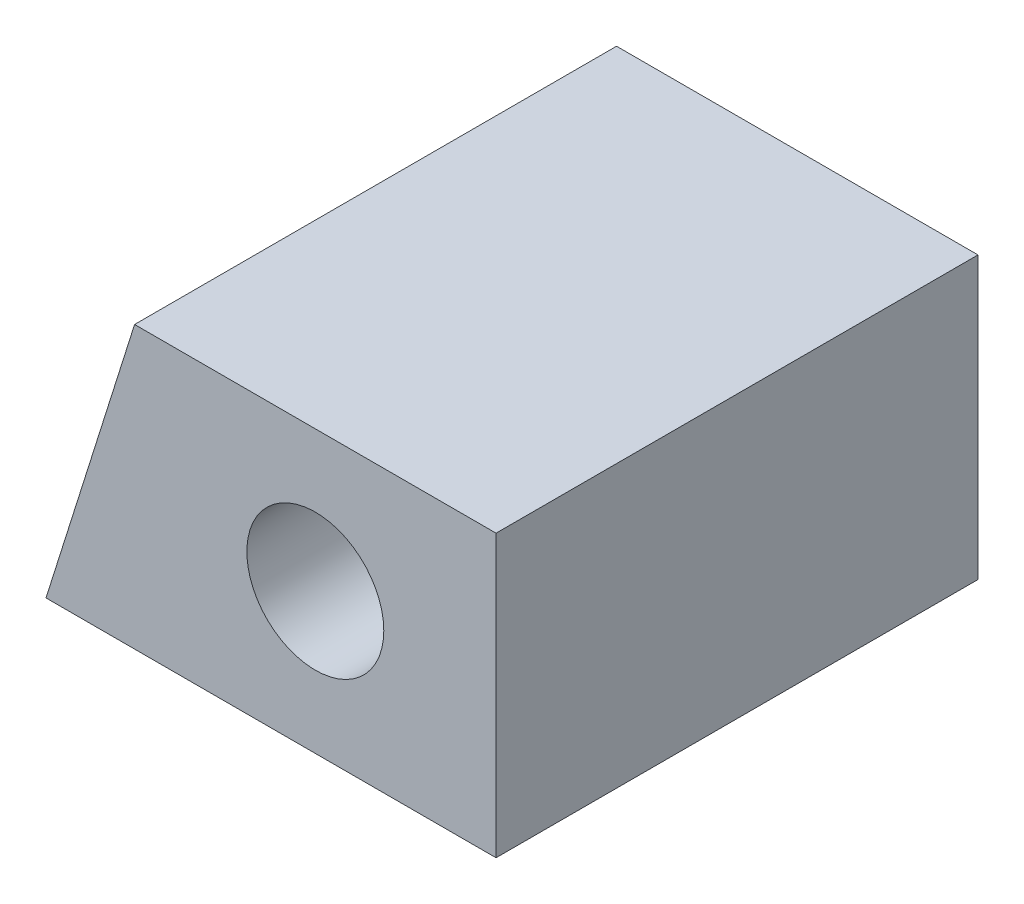
ISO-10303-21;
HEADER;
FILE_DESCRIPTION(('STEP AP214'),'2;1');
FILE_NAME('part.step','',(''),(''),'','','');
FILE_SCHEMA(('AUTOMOTIVE_DESIGN { 1 0 10303 214 1 1 1 1 }'));
ENDSEC;
DATA;
#1=APPLICATION_CONTEXT('core data for automotive mechanical design processes');
#2=APPLICATION_PROTOCOL_DEFINITION('international standard','automotive_design',2000,#1);
#3=PRODUCT_CONTEXT('',#1,'mechanical');
#4=PRODUCT('Part','Part','',(#3));
#5=PRODUCT_RELATED_PRODUCT_CATEGORY('part','',(#4));
#6=PRODUCT_DEFINITION_FORMATION('','',#4);
#7=PRODUCT_DEFINITION_CONTEXT('part definition',#1,'design');
#8=PRODUCT_DEFINITION('design','',#6,#7);
#9=PRODUCT_DEFINITION_SHAPE('','',#8);
#10=(LENGTH_UNIT() NAMED_UNIT(*) SI_UNIT(.MILLI.,.METRE.));
#11=(NAMED_UNIT(*) PLANE_ANGLE_UNIT() SI_UNIT($,.RADIAN.));
#12=(NAMED_UNIT(*) SI_UNIT($,.STERADIAN.) SOLID_ANGLE_UNIT());
#13=UNCERTAINTY_MEASURE_WITH_UNIT(LENGTH_MEASURE(1.E-05),#10,'distance_accuracy_value','');
#14=(GEOMETRIC_REPRESENTATION_CONTEXT(3) GLOBAL_UNCERTAINTY_ASSIGNED_CONTEXT((#13)) GLOBAL_UNIT_ASSIGNED_CONTEXT((#10,
#11,#12)) REPRESENTATION_CONTEXT('',''));
#15=CARTESIAN_POINT('',(0.,0.,0.));
#16=DIRECTION('',(0.,0.,1.));
#17=DIRECTION('',(1.,0.,0.));
#18=AXIS2_PLACEMENT_3D('',#15,#16,#17);
#19=CARTESIAN_POINT('',(0.,0.,12.));
#20=DIRECTION('',(0.,0.,-1.));
#21=DIRECTION('',(-1.,0.,0.));
#22=AXIS2_PLACEMENT_3D('',#19,#20,#21);
#23=PLANE('',#22);
#24=DIRECTION('',(-1.,0.,0.));
#25=VECTOR('',#24,1.);
#26=CARTESIAN_POINT('',(5.60287420464197,3.5,12.));
#27=LINE('',#26,#25);
#28=CARTESIAN_POINT('',(5.60287420464197,3.5,12.));
#29=VERTEX_POINT('',#28);
#30=CARTESIAN_POINT('',(-3.39712579535803,3.5,12.));
#31=VERTEX_POINT('',#30);
#32=EDGE_CURVE('E86',#29,#31,#27,.T.);
#33=ORIENTED_EDGE('',*,*,#32,.T.);
#34=DIRECTION('',(-0.300539339915884,-0.953769419284831,0.));
#35=VECTOR('',#34,1.);
#36=CARTESIAN_POINT('',(-3.39712579535803,3.5,12.));
#37=LINE('',#36,#35);
#38=CARTESIAN_POINT('',(-5.60287420464198,-3.5,12.));
#39=VERTEX_POINT('',#38);
#40=EDGE_CURVE('E81',#31,#39,#37,.T.);
#41=ORIENTED_EDGE('',*,*,#40,.T.);
#42=DIRECTION('',(1.,0.,0.));
#43=VECTOR('',#42,1.);
#44=CARTESIAN_POINT('',(-5.60287420464198,-3.5,12.));
#45=LINE('',#44,#43);
#46=CARTESIAN_POINT('',(5.60287420464197,-3.5,12.));
#47=VERTEX_POINT('',#46);
#48=EDGE_CURVE('E84',#39,#47,#45,.T.);
#49=ORIENTED_EDGE('',*,*,#48,.T.);
#50=DIRECTION('',(0.,1.,0.));
#51=VECTOR('',#50,1.);
#52=CARTESIAN_POINT('',(5.60287420464197,-3.5,12.));
#53=LINE('',#52,#51);
#54=EDGE_CURVE('E51',#47,#29,#53,.T.);
#55=ORIENTED_EDGE('',*,*,#54,.T.);
#56=EDGE_LOOP('',(#33,#41,#49,#55));
#57=FACE_BOUND('',#56,.T.);
#58=CARTESIAN_POINT('',(1.10287420464197,0.,12.));
#59=DIRECTION('',(0.,0.,1.));
#60=DIRECTION('',(1.,0.,0.));
#61=AXIS2_PLACEMENT_3D('',#58,#59,#60);
#62=CIRCLE('',#61,1.705);
#63=CARTESIAN_POINT('',(2.80787420464197,0.,12.));
#64=VERTEX_POINT('',#63);
#65=EDGE_CURVE('E101',#64,#64,#62,.T.);
#66=ORIENTED_EDGE('',*,*,#65,.F.);
#67=EDGE_LOOP('',(#66));
#68=FACE_BOUND('',#67,.T.);
#69=ADVANCED_FACE('F34',(#57,#68),#23,.F.);
#70=CARTESIAN_POINT('',(0.,0.,0.));
#71=DIRECTION('',(0.,0.,-1.));
#72=DIRECTION('',(-1.,0.,0.));
#73=AXIS2_PLACEMENT_3D('',#70,#71,#72);
#74=PLANE('',#73);
#75=DIRECTION('',(-1.,0.,0.));
#76=VECTOR('',#75,1.);
#77=CARTESIAN_POINT('',(5.60287420464197,3.5,0.));
#78=LINE('',#77,#76);
#79=CARTESIAN_POINT('',(5.60287420464197,3.5,0.));
#80=VERTEX_POINT('',#79);
#81=CARTESIAN_POINT('',(-3.39712579535803,3.5,0.));
#82=VERTEX_POINT('',#81);
#83=EDGE_CURVE('E98',#80,#82,#78,.T.);
#84=ORIENTED_EDGE('',*,*,#83,.F.);
#85=DIRECTION('',(0.,1.,0.));
#86=VECTOR('',#85,1.);
#87=CARTESIAN_POINT('',(5.60287420464197,-3.5,0.));
#88=LINE('',#87,#86);
#89=CARTESIAN_POINT('',(5.60287420464197,-3.5,0.));
#90=VERTEX_POINT('',#89);
#91=EDGE_CURVE('E74',#90,#80,#88,.T.);
#92=ORIENTED_EDGE('',*,*,#91,.F.);
#93=DIRECTION('',(1.,0.,0.));
#94=VECTOR('',#93,1.);
#95=CARTESIAN_POINT('',(-5.60287420464198,-3.5,0.));
#96=LINE('',#95,#94);
#97=CARTESIAN_POINT('',(-5.60287420464198,-3.5,0.));
#98=VERTEX_POINT('',#97);
#99=EDGE_CURVE('E68',#98,#90,#96,.T.);
#100=ORIENTED_EDGE('',*,*,#99,.F.);
#101=DIRECTION('',(-0.300539339915884,-0.953769419284831,0.));
#102=VECTOR('',#101,1.);
#103=CARTESIAN_POINT('',(-3.39712579535803,3.5,0.));
#104=LINE('',#103,#102);
#105=EDGE_CURVE('E90',#82,#98,#104,.T.);
#106=ORIENTED_EDGE('',*,*,#105,.F.);
#107=EDGE_LOOP('',(#84,#92,#100,#106));
#108=FACE_BOUND('',#107,.T.);
#109=CARTESIAN_POINT('',(1.10287420464197,0.,0.));
#110=DIRECTION('',(0.,0.,1.));
#111=DIRECTION('',(1.,0.,0.));
#112=AXIS2_PLACEMENT_3D('',#109,#110,#111);
#113=CIRCLE('',#112,1.705);
#114=CARTESIAN_POINT('',(2.80787420464197,0.,0.));
#115=VERTEX_POINT('',#114);
#116=EDGE_CURVE('E113',#115,#115,#113,.T.);
#117=ORIENTED_EDGE('',*,*,#116,.T.);
#118=EDGE_LOOP('',(#117));
#119=FACE_BOUND('',#118,.T.);
#120=ADVANCED_FACE('F109',(#108,#119),#74,.T.);
#121=CARTESIAN_POINT('',(5.60287420464197,3.5,12.));
#122=DIRECTION('',(0.,-1.,0.));
#123=DIRECTION('',(0.,0.,-1.));
#124=AXIS2_PLACEMENT_3D('',#121,#122,#123);
#125=PLANE('',#124);
#126=ORIENTED_EDGE('',*,*,#83,.T.);
#127=DIRECTION('',(0.,0.,-1.));
#128=VECTOR('',#127,1.);
#129=CARTESIAN_POINT('',(-3.39712579535803,3.5,12.));
#130=LINE('',#129,#128);
#131=EDGE_CURVE('E11',#31,#82,#130,.T.);
#132=ORIENTED_EDGE('',*,*,#131,.F.);
#133=ORIENTED_EDGE('',*,*,#32,.F.);
#134=DIRECTION('',(0.,0.,-1.));
#135=VECTOR('',#134,1.);
#136=CARTESIAN_POINT('',(5.60287420464197,3.5,12.));
#137=LINE('',#136,#135);
#138=EDGE_CURVE('E94',#29,#80,#137,.T.);
#139=ORIENTED_EDGE('',*,*,#138,.T.);
#140=EDGE_LOOP('',(#126,#132,#133,#139));
#141=FACE_BOUND('',#140,.T.);
#142=ADVANCED_FACE('F36',(#141),#125,.F.);
#143=CARTESIAN_POINT('',(-3.39712579535803,3.5,12.));
#144=DIRECTION('',(0.953769419284831,-0.300539339915884,0.));
#145=DIRECTION('',(0.300539339915884,0.953769419284831,0.));
#146=AXIS2_PLACEMENT_3D('',#143,#144,#145);
#147=PLANE('',#146);
#148=ORIENTED_EDGE('',*,*,#105,.T.);
#149=DIRECTION('',(0.,0.,-1.));
#150=VECTOR('',#149,1.);
#151=CARTESIAN_POINT('',(-5.60287420464198,-3.5,12.));
#152=LINE('',#151,#150);
#153=EDGE_CURVE('E43',#39,#98,#152,.T.);
#154=ORIENTED_EDGE('',*,*,#153,.F.);
#155=ORIENTED_EDGE('',*,*,#40,.F.);
#156=ORIENTED_EDGE('',*,*,#131,.T.);
#157=EDGE_LOOP('',(#148,#154,#155,#156));
#158=FACE_BOUND('',#157,.T.);
#159=ADVANCED_FACE('F89',(#158),#147,.F.);
#160=CARTESIAN_POINT('',(-5.60287420464198,-3.5,12.));
#161=DIRECTION('',(0.,1.,0.));
#162=DIRECTION('',(-1.,0.,0.));
#163=AXIS2_PLACEMENT_3D('',#160,#161,#162);
#164=PLANE('',#163);
#165=ORIENTED_EDGE('',*,*,#99,.T.);
#166=DIRECTION('',(0.,0.,-1.));
#167=VECTOR('',#166,1.);
#168=CARTESIAN_POINT('',(5.60287420464197,-3.5,12.));
#169=LINE('',#168,#167);
#170=EDGE_CURVE('E91',#47,#90,#169,.T.);
#171=ORIENTED_EDGE('',*,*,#170,.F.);
#172=ORIENTED_EDGE('',*,*,#48,.F.);
#173=ORIENTED_EDGE('',*,*,#153,.T.);
#174=EDGE_LOOP('',(#165,#171,#172,#173));
#175=FACE_BOUND('',#174,.T.);
#176=ADVANCED_FACE('F92',(#175),#164,.F.);
#177=CARTESIAN_POINT('',(5.60287420464197,-3.5,12.));
#178=DIRECTION('',(-1.,0.,0.));
#179=DIRECTION('',(0.,0.,1.));
#180=AXIS2_PLACEMENT_3D('',#177,#178,#179);
#181=PLANE('',#180);
#182=ORIENTED_EDGE('',*,*,#91,.T.);
#183=ORIENTED_EDGE('',*,*,#138,.F.);
#184=ORIENTED_EDGE('',*,*,#54,.F.);
#185=ORIENTED_EDGE('',*,*,#170,.T.);
#186=EDGE_LOOP('',(#182,#183,#184,#185));
#187=FACE_BOUND('',#186,.T.);
#188=ADVANCED_FACE('F106',(#187),#181,.F.);
#189=CARTESIAN_POINT('',(1.10287420464197,0.,12.));
#190=DIRECTION('',(0.,0.,-1.));
#191=DIRECTION('',(-1.,0.,0.));
#192=AXIS2_PLACEMENT_3D('',#189,#190,#191);
#193=CYLINDRICAL_SURFACE('',#192,1.705);
#194=ORIENTED_EDGE('',*,*,#65,.T.);
#195=EDGE_LOOP('',(#194));
#196=FACE_BOUND('',#195,.T.);
#197=ORIENTED_EDGE('',*,*,#116,.F.);
#198=EDGE_LOOP('',(#197));
#199=FACE_BOUND('',#198,.T.);
#200=ADVANCED_FACE('F119',(#196,#199),#193,.F.);
#201=CLOSED_SHELL('',(#69,#120,#142,#159,#176,#188,#200));
#202=MANIFOLD_SOLID_BREP('B2',#201);
#203=ADVANCED_BREP_SHAPE_REPRESENTATION('',(#18,#202),#14);
#204=SHAPE_DEFINITION_REPRESENTATION(#9,#203);
ENDSEC;
END-ISO-10303-21;
